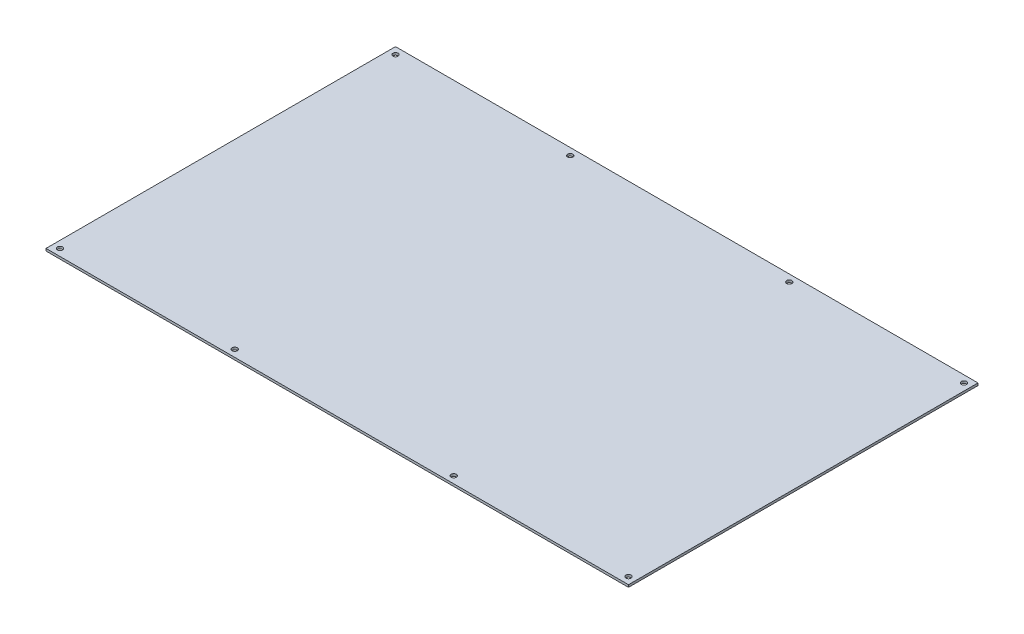
ISO-10303-21;
HEADER;
FILE_DESCRIPTION(('STEP AP214'),'2;1');
FILE_NAME('part.step','',(''),(''),'','','');
FILE_SCHEMA(('AUTOMOTIVE_DESIGN { 1 0 10303 214 1 1 1 1 }'));
ENDSEC;
DATA;
#1=APPLICATION_CONTEXT('core data for automotive mechanical design processes');
#2=APPLICATION_PROTOCOL_DEFINITION('international standard','automotive_design',2000,#1);
#3=PRODUCT_CONTEXT('',#1,'mechanical');
#4=PRODUCT('Part','Part','',(#3));
#5=PRODUCT_RELATED_PRODUCT_CATEGORY('part','',(#4));
#6=PRODUCT_DEFINITION_FORMATION('','',#4);
#7=PRODUCT_DEFINITION_CONTEXT('part definition',#1,'design');
#8=PRODUCT_DEFINITION('design','',#6,#7);
#9=PRODUCT_DEFINITION_SHAPE('','',#8);
#10=(LENGTH_UNIT() NAMED_UNIT(*) SI_UNIT(.MILLI.,.METRE.));
#11=(NAMED_UNIT(*) PLANE_ANGLE_UNIT() SI_UNIT($,.RADIAN.));
#12=(NAMED_UNIT(*) SI_UNIT($,.STERADIAN.) SOLID_ANGLE_UNIT());
#13=UNCERTAINTY_MEASURE_WITH_UNIT(LENGTH_MEASURE(1.E-05),#10,'distance_accuracy_value','');
#14=(GEOMETRIC_REPRESENTATION_CONTEXT(3) GLOBAL_UNCERTAINTY_ASSIGNED_CONTEXT((#13)) GLOBAL_UNIT_ASSIGNED_CONTEXT((#10,
#11,#12)) REPRESENTATION_CONTEXT('',''));
#15=CARTESIAN_POINT('',(0.,0.,0.));
#16=DIRECTION('',(0.,0.,1.));
#17=DIRECTION('',(1.,0.,0.));
#18=AXIS2_PLACEMENT_3D('',#15,#16,#17);
#19=CARTESIAN_POINT('',(0.,0.,0.));
#20=DIRECTION('',(0.,-1.,0.));
#21=DIRECTION('',(0.,0.,-1.));
#22=AXIS2_PLACEMENT_3D('',#19,#20,#21);
#23=PLANE('',#22);
#24=CARTESIAN_POINT('',(93.9999999999999,0.,-144.));
#25=DIRECTION('',(0.,1.,0.));
#26=DIRECTION('',(0.,0.,1.));
#27=AXIS2_PLACEMENT_3D('',#24,#25,#26);
#28=CIRCLE('',#27,2.24999999999999);
#29=CARTESIAN_POINT('',(93.9999999999999,0.,-141.75));
#30=VERTEX_POINT('',#29);
#31=EDGE_CURVE('E176',#30,#30,#28,.T.);
#32=ORIENTED_EDGE('',*,*,#31,.F.);
#33=EDGE_LOOP('',(#32));
#34=FACE_BOUND('',#33,.T.);
#35=CARTESIAN_POINT('',(-94.,0.,-144.));
#36=DIRECTION('',(0.,1.,0.));
#37=DIRECTION('',(0.,0.,1.));
#38=AXIS2_PLACEMENT_3D('',#35,#36,#37);
#39=CIRCLE('',#38,2.24999999999999);
#40=CARTESIAN_POINT('',(-94.,0.,-141.75));
#41=VERTEX_POINT('',#40);
#42=EDGE_CURVE('E185',#41,#41,#39,.T.);
#43=ORIENTED_EDGE('',*,*,#42,.F.);
#44=EDGE_LOOP('',(#43));
#45=FACE_BOUND('',#44,.T.);
#46=CARTESIAN_POINT('',(-244.,0.,-144.));
#47=DIRECTION('',(0.,1.,0.));
#48=DIRECTION('',(0.,0.,1.));
#49=AXIS2_PLACEMENT_3D('',#46,#47,#48);
#50=CIRCLE('',#49,2.24999999999997);
#51=CARTESIAN_POINT('',(-244.,0.,-141.75));
#52=VERTEX_POINT('',#51);
#53=EDGE_CURVE('E191',#52,#52,#50,.T.);
#54=ORIENTED_EDGE('',*,*,#53,.F.);
#55=EDGE_LOOP('',(#54));
#56=FACE_BOUND('',#55,.T.);
#57=CARTESIAN_POINT('',(-244.,0.,144.));
#58=DIRECTION('',(0.,1.,0.));
#59=DIRECTION('',(0.,0.,1.));
#60=AXIS2_PLACEMENT_3D('',#57,#58,#59);
#61=CIRCLE('',#60,2.24999999999997);
#62=CARTESIAN_POINT('',(-244.,0.,146.25));
#63=VERTEX_POINT('',#62);
#64=EDGE_CURVE('E197',#63,#63,#61,.T.);
#65=ORIENTED_EDGE('',*,*,#64,.F.);
#66=EDGE_LOOP('',(#65));
#67=FACE_BOUND('',#66,.T.);
#68=CARTESIAN_POINT('',(-94.,0.,144.));
#69=DIRECTION('',(0.,1.,0.));
#70=DIRECTION('',(0.,0.,1.));
#71=AXIS2_PLACEMENT_3D('',#68,#69,#70);
#72=CIRCLE('',#71,2.24999999999999);
#73=CARTESIAN_POINT('',(-94.,0.,146.25));
#74=VERTEX_POINT('',#73);
#75=EDGE_CURVE('E203',#74,#74,#72,.T.);
#76=ORIENTED_EDGE('',*,*,#75,.F.);
#77=EDGE_LOOP('',(#76));
#78=FACE_BOUND('',#77,.T.);
#79=CARTESIAN_POINT('',(93.9999999999999,0.,144.));
#80=DIRECTION('',(0.,1.,0.));
#81=DIRECTION('',(0.,0.,1.));
#82=AXIS2_PLACEMENT_3D('',#79,#80,#81);
#83=CIRCLE('',#82,2.24999999999999);
#84=CARTESIAN_POINT('',(93.9999999999999,0.,146.25));
#85=VERTEX_POINT('',#84);
#86=EDGE_CURVE('E209',#85,#85,#83,.T.);
#87=ORIENTED_EDGE('',*,*,#86,.F.);
#88=EDGE_LOOP('',(#87));
#89=FACE_BOUND('',#88,.T.);
#90=CARTESIAN_POINT('',(244.,0.,144.));
#91=DIRECTION('',(0.,1.,0.));
#92=DIRECTION('',(0.,0.,1.));
#93=AXIS2_PLACEMENT_3D('',#90,#91,#92);
#94=CIRCLE('',#93,2.24999999999997);
#95=CARTESIAN_POINT('',(244.,0.,146.25));
#96=VERTEX_POINT('',#95);
#97=EDGE_CURVE('E215',#96,#96,#94,.T.);
#98=ORIENTED_EDGE('',*,*,#97,.F.);
#99=EDGE_LOOP('',(#98));
#100=FACE_BOUND('',#99,.T.);
#101=DIRECTION('',(0.,0.,-1.));
#102=VECTOR('',#101,1.);
#103=CARTESIAN_POINT('',(250.,0.,150.));
#104=LINE('',#103,#102);
#105=CARTESIAN_POINT('',(250.,0.,150.));
#106=VERTEX_POINT('',#105);
#107=CARTESIAN_POINT('',(250.,0.,-150.));
#108=VERTEX_POINT('',#107);
#109=EDGE_CURVE('E106',#106,#108,#104,.T.);
#110=ORIENTED_EDGE('',*,*,#109,.T.);
#111=DIRECTION('',(-1.,0.,0.));
#112=VECTOR('',#111,1.);
#113=CARTESIAN_POINT('',(-250.,0.,-150.));
#114=LINE('',#113,#112);
#115=CARTESIAN_POINT('',(-250.,0.,-150.));
#116=VERTEX_POINT('',#115);
#117=EDGE_CURVE('E109',#108,#116,#114,.T.);
#118=ORIENTED_EDGE('',*,*,#117,.T.);
#119=DIRECTION('',(0.,0.,1.));
#120=VECTOR('',#119,1.);
#121=CARTESIAN_POINT('',(-250.,0.,150.));
#122=LINE('',#121,#120);
#123=CARTESIAN_POINT('',(-250.,0.,150.));
#124=VERTEX_POINT('',#123);
#125=EDGE_CURVE('E91',#116,#124,#122,.T.);
#126=ORIENTED_EDGE('',*,*,#125,.T.);
#127=DIRECTION('',(1.,0.,0.));
#128=VECTOR('',#127,1.);
#129=CARTESIAN_POINT('',(-250.,0.,150.));
#130=LINE('',#129,#128);
#131=EDGE_CURVE('E101',#124,#106,#130,.T.);
#132=ORIENTED_EDGE('',*,*,#131,.T.);
#133=EDGE_LOOP('',(#110,#118,#126,#132));
#134=FACE_BOUND('',#133,.T.);
#135=CARTESIAN_POINT('',(244.,0.,-144.));
#136=DIRECTION('',(0.,1.,0.));
#137=DIRECTION('',(0.,0.,1.));
#138=AXIS2_PLACEMENT_3D('',#135,#136,#137);
#139=CIRCLE('',#138,2.24999999999997);
#140=CARTESIAN_POINT('',(244.,0.,-141.75));
#141=VERTEX_POINT('',#140);
#142=EDGE_CURVE('E172',#141,#141,#139,.T.);
#143=ORIENTED_EDGE('',*,*,#142,.F.);
#144=EDGE_LOOP('',(#143));
#145=FACE_BOUND('',#144,.T.);
#146=ADVANCED_FACE('F40',(#34,#45,#56,#67,#78,#89,#100,#134,#145),#23,.F.);
#147=CARTESIAN_POINT('',(250.,-2.,150.));
#148=DIRECTION('',(1.,0.,0.));
#149=DIRECTION('',(0.,0.,-1.));
#150=AXIS2_PLACEMENT_3D('',#147,#148,#149);
#151=PLANE('',#150);
#152=ORIENTED_EDGE('',*,*,#109,.F.);
#153=DIRECTION('',(0.,1.,0.));
#154=VECTOR('',#153,1.);
#155=CARTESIAN_POINT('',(250.,-2.,150.));
#156=LINE('',#155,#154);
#157=CARTESIAN_POINT('',(250.,-2.,150.));
#158=VERTEX_POINT('',#157);
#159=EDGE_CURVE('E11',#158,#106,#156,.T.);
#160=ORIENTED_EDGE('',*,*,#159,.F.);
#161=DIRECTION('',(0.,0.,-1.));
#162=VECTOR('',#161,1.);
#163=CARTESIAN_POINT('',(250.,-2.,150.));
#164=LINE('',#163,#162);
#165=CARTESIAN_POINT('',(250.,-2.,-150.));
#166=VERTEX_POINT('',#165);
#167=EDGE_CURVE('E99',#158,#166,#164,.T.);
#168=ORIENTED_EDGE('',*,*,#167,.T.);
#169=DIRECTION('',(0.,1.,0.));
#170=VECTOR('',#169,1.);
#171=CARTESIAN_POINT('',(250.,-2.,-150.));
#172=LINE('',#171,#170);
#173=EDGE_CURVE('E44',#166,#108,#172,.T.);
#174=ORIENTED_EDGE('',*,*,#173,.T.);
#175=EDGE_LOOP('',(#152,#160,#168,#174));
#176=FACE_BOUND('',#175,.T.);
#177=ADVANCED_FACE('F42',(#176),#151,.T.);
#178=CARTESIAN_POINT('',(-250.,-2.,150.));
#179=DIRECTION('',(0.,0.,1.));
#180=DIRECTION('',(1.,0.,0.));
#181=AXIS2_PLACEMENT_3D('',#178,#179,#180);
#182=PLANE('',#181);
#183=ORIENTED_EDGE('',*,*,#131,.F.);
#184=DIRECTION('',(0.,1.,0.));
#185=VECTOR('',#184,1.);
#186=CARTESIAN_POINT('',(-250.,-2.,150.));
#187=LINE('',#186,#185);
#188=CARTESIAN_POINT('',(-250.,-2.,150.));
#189=VERTEX_POINT('',#188);
#190=EDGE_CURVE('E50',#189,#124,#187,.T.);
#191=ORIENTED_EDGE('',*,*,#190,.F.);
#192=DIRECTION('',(1.,0.,0.));
#193=VECTOR('',#192,1.);
#194=CARTESIAN_POINT('',(-250.,-2.,150.));
#195=LINE('',#194,#193);
#196=EDGE_CURVE('E96',#189,#158,#195,.T.);
#197=ORIENTED_EDGE('',*,*,#196,.T.);
#198=ORIENTED_EDGE('',*,*,#159,.T.);
#199=EDGE_LOOP('',(#183,#191,#197,#198));
#200=FACE_BOUND('',#199,.T.);
#201=ADVANCED_FACE('F117',(#200),#182,.T.);
#202=CARTESIAN_POINT('',(-250.,-2.,150.));
#203=DIRECTION('',(-1.,0.,0.));
#204=DIRECTION('',(0.,0.,1.));
#205=AXIS2_PLACEMENT_3D('',#202,#203,#204);
#206=PLANE('',#205);
#207=ORIENTED_EDGE('',*,*,#125,.F.);
#208=DIRECTION('',(0.,1.,0.));
#209=VECTOR('',#208,1.);
#210=CARTESIAN_POINT('',(-250.,-2.,-150.));
#211=LINE('',#210,#209);
#212=CARTESIAN_POINT('',(-250.,-2.,-150.));
#213=VERTEX_POINT('',#212);
#214=EDGE_CURVE('E86',#213,#116,#211,.T.);
#215=ORIENTED_EDGE('',*,*,#214,.F.);
#216=DIRECTION('',(0.,0.,1.));
#217=VECTOR('',#216,1.);
#218=CARTESIAN_POINT('',(-250.,-2.,150.));
#219=LINE('',#218,#217);
#220=EDGE_CURVE('E89',#213,#189,#219,.T.);
#221=ORIENTED_EDGE('',*,*,#220,.T.);
#222=ORIENTED_EDGE('',*,*,#190,.T.);
#223=EDGE_LOOP('',(#207,#215,#221,#222));
#224=FACE_BOUND('',#223,.T.);
#225=ADVANCED_FACE('F88',(#224),#206,.T.);
#226=CARTESIAN_POINT('',(-250.,-2.,-150.));
#227=DIRECTION('',(0.,0.,-1.));
#228=DIRECTION('',(-1.,0.,0.));
#229=AXIS2_PLACEMENT_3D('',#226,#227,#228);
#230=PLANE('',#229);
#231=ORIENTED_EDGE('',*,*,#117,.F.);
#232=ORIENTED_EDGE('',*,*,#173,.F.);
#233=DIRECTION('',(-1.,0.,0.));
#234=VECTOR('',#233,1.);
#235=CARTESIAN_POINT('',(-250.,-2.,-150.));
#236=LINE('',#235,#234);
#237=EDGE_CURVE('E95',#166,#213,#236,.T.);
#238=ORIENTED_EDGE('',*,*,#237,.T.);
#239=ORIENTED_EDGE('',*,*,#214,.T.);
#240=EDGE_LOOP('',(#231,#232,#238,#239));
#241=FACE_BOUND('',#240,.T.);
#242=ADVANCED_FACE('F98',(#241),#230,.T.);
#243=CARTESIAN_POINT('',(0.,-2.,0.));
#244=DIRECTION('',(0.,-1.,0.));
#245=DIRECTION('',(0.,0.,-1.));
#246=AXIS2_PLACEMENT_3D('',#243,#244,#245);
#247=PLANE('',#246);
#248=CARTESIAN_POINT('',(244.,-2.,-144.));
#249=DIRECTION('',(0.,-1.,0.));
#250=DIRECTION('',(0.,0.,-1.));
#251=AXIS2_PLACEMENT_3D('',#248,#249,#250);
#252=CIRCLE('',#251,2.24999999999999);
#253=CARTESIAN_POINT('',(244.,-2.,-146.25));
#254=VERTEX_POINT('',#253);
#255=EDGE_CURVE('E175',#254,#254,#252,.T.);
#256=ORIENTED_EDGE('',*,*,#255,.F.);
#257=EDGE_LOOP('',(#256));
#258=FACE_BOUND('',#257,.T.);
#259=CARTESIAN_POINT('',(93.9999999999999,-2.,-144.));
#260=DIRECTION('',(0.,-1.,0.));
#261=DIRECTION('',(0.,0.,-1.));
#262=AXIS2_PLACEMENT_3D('',#259,#260,#261);
#263=CIRCLE('',#262,2.25);
#264=CARTESIAN_POINT('',(93.9999999999999,-2.,-146.25));
#265=VERTEX_POINT('',#264);
#266=EDGE_CURVE('E179',#265,#265,#263,.T.);
#267=ORIENTED_EDGE('',*,*,#266,.F.);
#268=EDGE_LOOP('',(#267));
#269=FACE_BOUND('',#268,.T.);
#270=CARTESIAN_POINT('',(-94.,-2.,-144.));
#271=DIRECTION('',(0.,-1.,0.));
#272=DIRECTION('',(0.,0.,-1.));
#273=AXIS2_PLACEMENT_3D('',#270,#271,#272);
#274=CIRCLE('',#273,2.25);
#275=CARTESIAN_POINT('',(-94.,-2.,-146.25));
#276=VERTEX_POINT('',#275);
#277=EDGE_CURVE('E188',#276,#276,#274,.T.);
#278=ORIENTED_EDGE('',*,*,#277,.F.);
#279=EDGE_LOOP('',(#278));
#280=FACE_BOUND('',#279,.T.);
#281=CARTESIAN_POINT('',(-244.,-2.,-144.));
#282=DIRECTION('',(0.,-1.,0.));
#283=DIRECTION('',(0.,0.,-1.));
#284=AXIS2_PLACEMENT_3D('',#281,#282,#283);
#285=CIRCLE('',#284,2.24999999999999);
#286=CARTESIAN_POINT('',(-244.,-2.,-146.25));
#287=VERTEX_POINT('',#286);
#288=EDGE_CURVE('E194',#287,#287,#285,.T.);
#289=ORIENTED_EDGE('',*,*,#288,.F.);
#290=EDGE_LOOP('',(#289));
#291=FACE_BOUND('',#290,.T.);
#292=CARTESIAN_POINT('',(-244.,-2.,144.));
#293=DIRECTION('',(0.,-1.,0.));
#294=DIRECTION('',(0.,0.,-1.));
#295=AXIS2_PLACEMENT_3D('',#292,#293,#294);
#296=CIRCLE('',#295,2.24999999999999);
#297=CARTESIAN_POINT('',(-244.,-2.,141.75));
#298=VERTEX_POINT('',#297);
#299=EDGE_CURVE('E200',#298,#298,#296,.T.);
#300=ORIENTED_EDGE('',*,*,#299,.F.);
#301=EDGE_LOOP('',(#300));
#302=FACE_BOUND('',#301,.T.);
#303=CARTESIAN_POINT('',(-94.,-2.,144.));
#304=DIRECTION('',(0.,-1.,0.));
#305=DIRECTION('',(0.,0.,-1.));
#306=AXIS2_PLACEMENT_3D('',#303,#304,#305);
#307=CIRCLE('',#306,2.25);
#308=CARTESIAN_POINT('',(-94.,-2.,141.75));
#309=VERTEX_POINT('',#308);
#310=EDGE_CURVE('E206',#309,#309,#307,.T.);
#311=ORIENTED_EDGE('',*,*,#310,.F.);
#312=EDGE_LOOP('',(#311));
#313=FACE_BOUND('',#312,.T.);
#314=CARTESIAN_POINT('',(93.9999999999999,-2.,144.));
#315=DIRECTION('',(0.,-1.,0.));
#316=DIRECTION('',(0.,0.,-1.));
#317=AXIS2_PLACEMENT_3D('',#314,#315,#316);
#318=CIRCLE('',#317,2.25);
#319=CARTESIAN_POINT('',(93.9999999999999,-2.,141.75));
#320=VERTEX_POINT('',#319);
#321=EDGE_CURVE('E212',#320,#320,#318,.T.);
#322=ORIENTED_EDGE('',*,*,#321,.F.);
#323=EDGE_LOOP('',(#322));
#324=FACE_BOUND('',#323,.T.);
#325=CARTESIAN_POINT('',(244.,-2.,144.));
#326=DIRECTION('',(0.,-1.,0.));
#327=DIRECTION('',(0.,0.,-1.));
#328=AXIS2_PLACEMENT_3D('',#325,#326,#327);
#329=CIRCLE('',#328,2.24999999999999);
#330=CARTESIAN_POINT('',(244.,-2.,141.75));
#331=VERTEX_POINT('',#330);
#332=EDGE_CURVE('E110',#331,#331,#329,.T.);
#333=ORIENTED_EDGE('',*,*,#332,.F.);
#334=EDGE_LOOP('',(#333));
#335=FACE_BOUND('',#334,.T.);
#336=ORIENTED_EDGE('',*,*,#167,.F.);
#337=ORIENTED_EDGE('',*,*,#196,.F.);
#338=ORIENTED_EDGE('',*,*,#220,.F.);
#339=ORIENTED_EDGE('',*,*,#237,.F.);
#340=EDGE_LOOP('',(#336,#337,#338,#339));
#341=FACE_BOUND('',#340,.T.);
#342=ADVANCED_FACE('F94',(#258,#269,#280,#291,#302,#313,#324,#335,#341),#247,.T.);
#343=CARTESIAN_POINT('',(244.,0.,144.));
#344=DIRECTION('',(0.,1.,0.));
#345=DIRECTION('',(0.,0.,1.));
#346=AXIS2_PLACEMENT_3D('',#343,#344,#345);
#347=CYLINDRICAL_SURFACE('',#346,2.24999999999999);
#348=ORIENTED_EDGE('',*,*,#97,.T.);
#349=EDGE_LOOP('',(#348));
#350=FACE_BOUND('',#349,.T.);
#351=ORIENTED_EDGE('',*,*,#332,.T.);
#352=EDGE_LOOP('',(#351));
#353=FACE_BOUND('',#352,.T.);
#354=ADVANCED_FACE('F135',(#350,#353),#347,.F.);
#355=CARTESIAN_POINT('',(93.9999999999999,0.,144.));
#356=DIRECTION('',(0.,1.,0.));
#357=DIRECTION('',(0.,0.,1.));
#358=AXIS2_PLACEMENT_3D('',#355,#356,#357);
#359=CYLINDRICAL_SURFACE('',#358,2.25);
#360=ORIENTED_EDGE('',*,*,#86,.T.);
#361=EDGE_LOOP('',(#360));
#362=FACE_BOUND('',#361,.T.);
#363=ORIENTED_EDGE('',*,*,#321,.T.);
#364=EDGE_LOOP('',(#363));
#365=FACE_BOUND('',#364,.T.);
#366=ADVANCED_FACE('F139',(#362,#365),#359,.F.);
#367=CARTESIAN_POINT('',(-94.,0.,144.));
#368=DIRECTION('',(0.,1.,0.));
#369=DIRECTION('',(0.,0.,1.));
#370=AXIS2_PLACEMENT_3D('',#367,#368,#369);
#371=CYLINDRICAL_SURFACE('',#370,2.25);
#372=ORIENTED_EDGE('',*,*,#75,.T.);
#373=EDGE_LOOP('',(#372));
#374=FACE_BOUND('',#373,.T.);
#375=ORIENTED_EDGE('',*,*,#310,.T.);
#376=EDGE_LOOP('',(#375));
#377=FACE_BOUND('',#376,.T.);
#378=ADVANCED_FACE('F143',(#374,#377),#371,.F.);
#379=CARTESIAN_POINT('',(-244.,0.,144.));
#380=DIRECTION('',(0.,1.,0.));
#381=DIRECTION('',(0.,0.,1.));
#382=AXIS2_PLACEMENT_3D('',#379,#380,#381);
#383=CYLINDRICAL_SURFACE('',#382,2.24999999999999);
#384=ORIENTED_EDGE('',*,*,#64,.T.);
#385=EDGE_LOOP('',(#384));
#386=FACE_BOUND('',#385,.T.);
#387=ORIENTED_EDGE('',*,*,#299,.T.);
#388=EDGE_LOOP('',(#387));
#389=FACE_BOUND('',#388,.T.);
#390=ADVANCED_FACE('F147',(#386,#389),#383,.F.);
#391=CARTESIAN_POINT('',(-244.,0.,-144.));
#392=DIRECTION('',(0.,1.,0.));
#393=DIRECTION('',(0.,0.,1.));
#394=AXIS2_PLACEMENT_3D('',#391,#392,#393);
#395=CYLINDRICAL_SURFACE('',#394,2.24999999999999);
#396=ORIENTED_EDGE('',*,*,#53,.T.);
#397=EDGE_LOOP('',(#396));
#398=FACE_BOUND('',#397,.T.);
#399=ORIENTED_EDGE('',*,*,#288,.T.);
#400=EDGE_LOOP('',(#399));
#401=FACE_BOUND('',#400,.T.);
#402=ADVANCED_FACE('F151',(#398,#401),#395,.F.);
#403=CARTESIAN_POINT('',(-94.,0.,-144.));
#404=DIRECTION('',(0.,1.,0.));
#405=DIRECTION('',(0.,0.,1.));
#406=AXIS2_PLACEMENT_3D('',#403,#404,#405);
#407=CYLINDRICAL_SURFACE('',#406,2.25);
#408=ORIENTED_EDGE('',*,*,#42,.T.);
#409=EDGE_LOOP('',(#408));
#410=FACE_BOUND('',#409,.T.);
#411=ORIENTED_EDGE('',*,*,#277,.T.);
#412=EDGE_LOOP('',(#411));
#413=FACE_BOUND('',#412,.T.);
#414=ADVANCED_FACE('F155',(#410,#413),#407,.F.);
#415=CARTESIAN_POINT('',(93.9999999999999,0.,-144.));
#416=DIRECTION('',(0.,1.,0.));
#417=DIRECTION('',(0.,0.,1.));
#418=AXIS2_PLACEMENT_3D('',#415,#416,#417);
#419=CYLINDRICAL_SURFACE('',#418,2.25);
#420=ORIENTED_EDGE('',*,*,#31,.T.);
#421=EDGE_LOOP('',(#420));
#422=FACE_BOUND('',#421,.T.);
#423=ORIENTED_EDGE('',*,*,#266,.T.);
#424=EDGE_LOOP('',(#423));
#425=FACE_BOUND('',#424,.T.);
#426=ADVANCED_FACE('F159',(#422,#425),#419,.F.);
#427=CARTESIAN_POINT('',(244.,0.,-144.));
#428=DIRECTION('',(0.,1.,0.));
#429=DIRECTION('',(0.,0.,1.));
#430=AXIS2_PLACEMENT_3D('',#427,#428,#429);
#431=CYLINDRICAL_SURFACE('',#430,2.24999999999999);
#432=ORIENTED_EDGE('',*,*,#142,.T.);
#433=EDGE_LOOP('',(#432));
#434=FACE_BOUND('',#433,.T.);
#435=ORIENTED_EDGE('',*,*,#255,.T.);
#436=EDGE_LOOP('',(#435));
#437=FACE_BOUND('',#436,.T.);
#438=ADVANCED_FACE('F163',(#434,#437),#431,.F.);
#439=CLOSED_SHELL('',(#146,#177,#201,#225,#242,#342,#354,#366,#378,#390,#402,#414,#426,#438));
#440=MANIFOLD_SOLID_BREP('B2',#439);
#441=ADVANCED_BREP_SHAPE_REPRESENTATION('',(#18,#440),#14);
#442=SHAPE_DEFINITION_REPRESENTATION(#9,#441);
ENDSEC;
END-ISO-10303-21;
